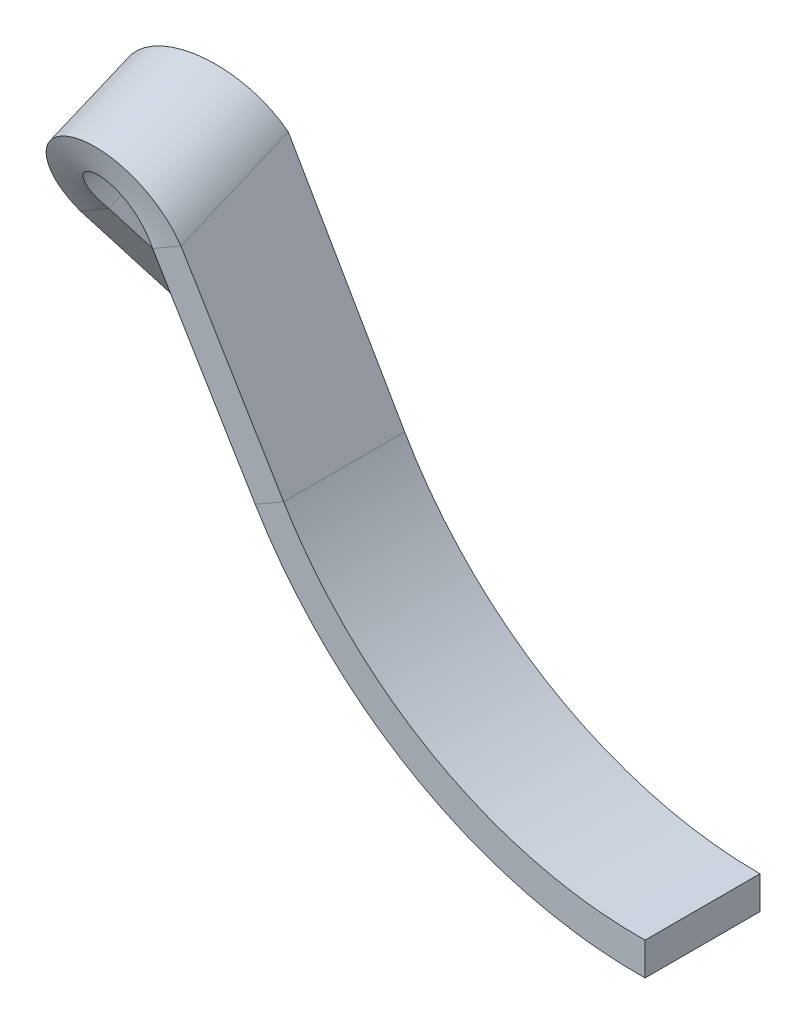
ISO-10303-21;
HEADER;
FILE_DESCRIPTION(('STEP AP214'),'2;1');
FILE_NAME('part.step','',(''),(''),'','','');
FILE_SCHEMA(('AUTOMOTIVE_DESIGN { 1 0 10303 214 1 1 1 1 }'));
ENDSEC;
DATA;
#1=APPLICATION_CONTEXT('core data for automotive mechanical design processes');
#2=APPLICATION_PROTOCOL_DEFINITION('international standard','automotive_design',2000,#1);
#3=PRODUCT_CONTEXT('',#1,'mechanical');
#4=PRODUCT('Part','Part','',(#3));
#5=PRODUCT_RELATED_PRODUCT_CATEGORY('part','',(#4));
#6=PRODUCT_DEFINITION_FORMATION('','',#4);
#7=PRODUCT_DEFINITION_CONTEXT('part definition',#1,'design');
#8=PRODUCT_DEFINITION('design','',#6,#7);
#9=PRODUCT_DEFINITION_SHAPE('','',#8);
#10=(LENGTH_UNIT() NAMED_UNIT(*) SI_UNIT(.MILLI.,.METRE.));
#11=(NAMED_UNIT(*) PLANE_ANGLE_UNIT() SI_UNIT($,.RADIAN.));
#12=(NAMED_UNIT(*) SI_UNIT($,.STERADIAN.) SOLID_ANGLE_UNIT());
#13=UNCERTAINTY_MEASURE_WITH_UNIT(LENGTH_MEASURE(1.E-05),#10,'distance_accuracy_value','');
#14=(GEOMETRIC_REPRESENTATION_CONTEXT(3) GLOBAL_UNCERTAINTY_ASSIGNED_CONTEXT((#13)) GLOBAL_UNIT_ASSIGNED_CONTEXT((#10,
#11,#12)) REPRESENTATION_CONTEXT('',''));
#15=CARTESIAN_POINT('',(0.,0.,0.));
#16=DIRECTION('',(0.,0.,1.));
#17=DIRECTION('',(1.,0.,0.));
#18=AXIS2_PLACEMENT_3D('',#15,#16,#17);
#19=CARTESIAN_POINT('',(-8.66025403784438,4.99999999999999,10.));
#20=DIRECTION('',(-0.866025403784438,-0.500000000000001,0.));
#21=DIRECTION('',(0.500000000000001,-0.866025403784438,0.));
#22=AXIS2_PLACEMENT_3D('',#19,#20,#21);
#23=PLANE('',#22);
#24=DIRECTION('',(0.499951953594902,-0.865942184969686,-0.0138627698014347));
#25=VECTOR('',#24,1.);
#26=CARTESIAN_POINT('',(-8.70910873098918,5.08461881071497,2.95234657146394));
#27=LINE('',#26,#25);
#28=CARTESIAN_POINT('',(-11.0955950619202,9.21813438745605,3.01851955149149));
#29=VERTEX_POINT('',#28);
#30=CARTESIAN_POINT('',(-8.66025403784438,4.99999999999999,2.95099191856196));
#31=VERTEX_POINT('',#30);
#32=EDGE_CURVE('E66',#29,#31,#27,.T.);
#33=ORIENTED_EDGE('',*,*,#32,.T.);
#34=DIRECTION('',(0.,0.,-1.));
#35=VECTOR('',#34,1.);
#36=CARTESIAN_POINT('',(-8.66025403784438,4.99999999999999,10.));
#37=LINE('',#36,#35);
#38=CARTESIAN_POINT('',(-8.66025403784438,4.99999999999999,0.));
#39=VERTEX_POINT('',#38);
#40=EDGE_CURVE('E59',#31,#39,#37,.T.);
#41=ORIENTED_EDGE('',*,*,#40,.T.);
#42=DIRECTION('',(-0.500000000000001,0.866025403784438,0.));
#43=VECTOR('',#42,1.);
#44=CARTESIAN_POINT('',(-8.66025403784438,4.99999999999999,0.));
#45=LINE('',#44,#43);
#46=CARTESIAN_POINT('',(-11.5,9.91858428704207,0.));
#47=VERTEX_POINT('',#46);
#48=EDGE_CURVE('E74',#39,#47,#45,.T.);
#49=ORIENTED_EDGE('',*,*,#48,.T.);
#50=DIRECTION('',(-0.129409522551257,0.224143868042008,-0.96592582628907));
#51=VECTOR('',#50,1.);
#52=CARTESIAN_POINT('',(-10.1602540378444,7.59807621135337,10.));
#53=LINE('',#52,#51);
#54=EDGE_CURVE('E329',#29,#47,#53,.T.);
#55=ORIENTED_EDGE('',*,*,#54,.F.);
#56=EDGE_LOOP('',(#33,#41,#49,#55));
#57=FACE_BOUND('',#56,.T.);
#58=ADVANCED_FACE('F51',(#57),#23,.F.);
#59=CARTESIAN_POINT('',(-9.35307436087193,4.59999999999999,10.));
#60=DIRECTION('',(-0.866025403784438,-0.500000000000001,0.));
#61=DIRECTION('',(0.500000000000001,-0.866025403784438,0.));
#62=AXIS2_PLACEMENT_3D('',#59,#60,#61);
#63=PLANE('',#62);
#64=DIRECTION('',(0.,0.,-1.));
#65=VECTOR('',#64,1.);
#66=CARTESIAN_POINT('',(-9.35307436087193,4.59999999999999,10.));
#67=LINE('',#66,#65);
#68=CARTESIAN_POINT('',(-9.35307436087193,4.59999999999999,2.95099191856196));
#69=VERTEX_POINT('',#68);
#70=CARTESIAN_POINT('',(-9.35307436087193,4.59999999999999,0.));
#71=VERTEX_POINT('',#70);
#72=EDGE_CURVE('E156',#69,#71,#67,.T.);
#73=ORIENTED_EDGE('',*,*,#72,.F.);
#74=DIRECTION('',(0.499951953594902,-0.865942184969686,-0.0138627698014347));
#75=VECTOR('',#74,1.);
#76=CARTESIAN_POINT('',(-9.40192905401673,4.68461881071497,2.95234657146394));
#77=LINE('',#76,#75);
#78=CARTESIAN_POINT('',(-11.7884153849477,8.81813438745606,3.01851955149148));
#79=VERTEX_POINT('',#78);
#80=EDGE_CURVE('E325',#79,#69,#77,.T.);
#81=ORIENTED_EDGE('',*,*,#80,.F.);
#82=DIRECTION('',(-0.129409522551257,0.224143868042008,-0.96592582628907));
#83=VECTOR('',#82,1.);
#84=CARTESIAN_POINT('',(-10.853074360872,7.19807621135337,10.));
#85=LINE('',#84,#83);
#86=CARTESIAN_POINT('',(-12.1928203230275,9.51858428704208,0.));
#87=VERTEX_POINT('',#86);
#88=EDGE_CURVE('E414',#79,#87,#85,.T.);
#89=ORIENTED_EDGE('',*,*,#88,.T.);
#90=DIRECTION('',(-0.500000000000001,0.866025403784438,0.));
#91=VECTOR('',#90,1.);
#92=CARTESIAN_POINT('',(-9.35307436087193,4.59999999999999,0.));
#93=LINE('',#92,#91);
#94=EDGE_CURVE('E411',#71,#87,#93,.T.);
#95=ORIENTED_EDGE('',*,*,#94,.F.);
#96=EDGE_LOOP('',(#73,#81,#89,#95));
#97=FACE_BOUND('',#96,.T.);
#98=ADVANCED_FACE('F423',(#97),#63,.T.);
#99=CARTESIAN_POINT('',(0.,10.,0.));
#100=DIRECTION('',(0.,0.,1.));
#101=DIRECTION('',(1.,0.,0.));
#102=AXIS2_PLACEMENT_3D('',#99,#100,#101);
#103=PLANE('',#102);
#104=ORIENTED_EDGE('',*,*,#48,.F.);
#105=DIRECTION('',(-0.866025403784439,-0.5,0.));
#106=VECTOR('',#105,1.);
#107=CARTESIAN_POINT('',(-8.66025403784438,4.99999999999999,0.));
#108=LINE('',#107,#106);
#109=EDGE_CURVE('E284',#39,#71,#108,.T.);
#110=ORIENTED_EDGE('',*,*,#109,.T.);
#111=ORIENTED_EDGE('',*,*,#94,.T.);
#112=DIRECTION('',(0.866025403784439,0.499999999999999,0.));
#113=VECTOR('',#112,1.);
#114=CARTESIAN_POINT('',(-12.1928203230276,9.51858428704207,0.));
#115=LINE('',#114,#113);
#116=EDGE_CURVE('E287',#87,#47,#115,.T.);
#117=ORIENTED_EDGE('',*,*,#116,.T.);
#118=EDGE_LOOP('',(#104,#110,#111,#117));
#119=FACE_BOUND('',#118,.T.);
#120=ADVANCED_FACE('F308',(#119),#103,.F.);
#121=CARTESIAN_POINT('',(-8.70910873098918,5.08461881071497,2.95234657146394));
#122=DIRECTION('',(-0.00693138490071734,0.0120055108148582,-0.999903907189802));
#123=DIRECTION('',(0.499951953594902,-0.865942184969686,-0.0138627698014347));
#124=AXIS2_PLACEMENT_3D('',#121,#122,#123);
#125=PLANE('',#124);
#126=CARTESIAN_POINT('',(-8.66025403784438,4.99999999999999,2.95099191856196));
#127=CARTESIAN_POINT('',(-9.35307436087193,4.59999999999999,2.95099191856196));
#128=B_SPLINE_CURVE_WITH_KNOTS('',1,(#126,#127),.UNSPECIFIED.,.F.,.F.,(2,2),(0.,1.),.UNSPECIFIED.);
#129=EDGE_CURVE('E12',#31,#69,#128,.T.);
#130=ORIENTED_EDGE('',*,*,#129,.F.);
#131=ORIENTED_EDGE('',*,*,#32,.F.);
#132=CARTESIAN_POINT('',(-11.7884153849477,8.81813438745606,3.01851955149148));
#133=CARTESIAN_POINT('',(-11.0955950619202,9.21813438745606,3.01851955149148));
#134=B_SPLINE_CURVE_WITH_KNOTS('',1,(#132,#133),.UNSPECIFIED.,.F.,.F.,(2,2),(0.,1.),.UNSPECIFIED.);
#135=EDGE_CURVE('E332',#29,#79,#134,.F.);
#136=ORIENTED_EDGE('',*,*,#135,.T.);
#137=ORIENTED_EDGE('',*,*,#80,.T.);
#138=EDGE_LOOP('',(#130,#131,#136,#137));
#139=FACE_BOUND('',#138,.T.);
#140=ADVANCED_FACE('F297',(#139),#125,.F.);
#141=CARTESIAN_POINT('',(-11.0955950619202,9.21813438745606,3.01851955149148));
#142=CARTESIAN_POINT('',(-11.2322946099257,9.45490494997343,3.03516275506586));
#143=CARTESIAN_POINT('',(-11.4151035081526,9.6648272241181,3.05177287075833));
#144=CARTESIAN_POINT('',(-11.846590736162,10.0014212437597,3.0744799826965));
#145=CARTESIAN_POINT('',(-12.0950812019068,10.1279292172063,3.08052360526664));
#146=CARTESIAN_POINT('',(-12.6211682269415,10.2801461718338,3.07311983997961));
#147=CARTESIAN_POINT('',(-12.8985633612725,10.3058049058911,3.05963380640934));
#148=CARTESIAN_POINT('',(-13.4413125666929,10.2542026117992,3.00716592874818));
#149=CARTESIAN_POINT('',(-13.706458656967,10.1769715306974,2.96816316974808));
#150=CARTESIAN_POINT('',(-14.185395760213,9.93313743717271,2.86253854716561));
#151=CARTESIAN_POINT('',(-14.3990038997068,9.76664000680152,2.79591668358325));
#152=CARTESIAN_POINT('',(-14.7433694323159,9.37142711200837,2.63713531607947));
#153=CARTESIAN_POINT('',(-14.8739969001198,9.14287679073226,2.54499672706728));
#154=CARTESIAN_POINT('',(-15.0335186953649,8.66018414307598,2.34115124718938));
#155=CARTESIAN_POINT('',(-15.0623558256122,8.40624137938885,2.22948300203677));
#156=CARTESIAN_POINT('',(-15.0149025001671,7.91328602664222,1.99552664493367));
#157=CARTESIAN_POINT('',(-14.9386574935195,7.67451377564533,1.8733101914117));
#158=CARTESIAN_POINT('',(-14.8161114113672,7.46225773508906,1.75102408050189));
#159=CARTESIAN_POINT('',(-11.7884153849477,8.81813438745606,3.01851955149148));
#160=CARTESIAN_POINT('',(-11.8745294792953,8.96728837411391,3.00805471042918));
#161=CARTESIAN_POINT('',(-11.9887599560303,9.10007305526244,2.99757660076836));
#162=CARTESIAN_POINT('',(-12.2573842720988,9.31487829805639,2.97020303582042));
#163=CARTESIAN_POINT('',(-12.4116640226575,9.39679979971298,2.95327848907881));
#164=CARTESIAN_POINT('',(-12.7379711417902,9.4991800028641,2.9075446331399));
#165=CARTESIAN_POINT('',(-12.9098756902674,9.51960806586868,2.8787117594834));
#166=CARTESIAN_POINT('',(-13.246342675489,9.49770823931295,2.8054997862432));
#167=CARTESIAN_POINT('',(-13.4107782946631,9.45539861014735,2.76110793366607));
#168=CARTESIAN_POINT('',(-13.7083354614856,9.3162842717423,2.6554833110836));
#169=CARTESIAN_POINT('',(-13.8413455009157,9.21954394180268,2.59425054107827));
#170=CARTESIAN_POINT('',(-14.0568468319841,8.98812545628273,2.45621326915354));
#171=CARTESIAN_POINT('',(-14.1392589008715,8.85354799774255,2.37942152022757));
#172=CARTESIAN_POINT('',(-14.2420506359861,8.56878819950117,2.21390613100155));
#173=CARTESIAN_POINT('',(-14.2623954258756,8.4187275443689,2.1252060551607));
#174=CARTESIAN_POINT('',(-14.2389828191061,8.12770999912122,1.9413303749437));
#175=CARTESIAN_POINT('',(-14.195251871403,7.98689746750723,1.84620099305603));
#176=CARTESIAN_POINT('',(-14.1232910883397,7.86225773508907,1.75102408050189));
#177=B_SPLINE_SURFACE_WITH_KNOTS('',1,3,((#141,#142,#143,#144,#145,#146,#147,#148,#149,#150,
#151,#152,#153,#154,#155,#156,#157,#158),(#159,#160,#161,#162,#163,#164,#165,#166,#167,#168,
#169,#170,#171,#172,#173,#174,#175,#176)),.UNSPECIFIED.,.F.,.F.,.F.,(2,2),(4,2,2,2,2,2,2,2,4),
(0.,1.),(0.,0.125,0.25,0.375,0.5,0.625,0.75,0.875,1.),.UNSPECIFIED.);
#178=CARTESIAN_POINT('',(-11.0955950619202,9.21813438745606,3.01851955149148));
#179=CARTESIAN_POINT('',(-11.2322946099257,9.45490494997343,3.03516275506586));
#180=CARTESIAN_POINT('',(-11.4151035081526,9.6648272241181,3.05177287075833));
#181=CARTESIAN_POINT('',(-11.846590736162,10.0014212437597,3.0744799826965));
#182=CARTESIAN_POINT('',(-12.0950812019068,10.1279292172063,3.08052360526664));
#183=CARTESIAN_POINT('',(-12.6211682269415,10.2801461718338,3.07311983997961));
#184=CARTESIAN_POINT('',(-12.8985633612725,10.3058049058911,3.05963380640934));
#185=CARTESIAN_POINT('',(-13.4413125666929,10.2542026117992,3.00716592874818));
#186=CARTESIAN_POINT('',(-13.706458656967,10.1769715306974,2.96816316974808));
#187=CARTESIAN_POINT('',(-14.185395760213,9.93313743717271,2.86253854716561));
#188=CARTESIAN_POINT('',(-14.3990038997068,9.76664000680152,2.79591668358325));
#189=CARTESIAN_POINT('',(-14.7433694323159,9.37142711200837,2.63713531607947));
#190=CARTESIAN_POINT('',(-14.8739969001198,9.14287679073226,2.54499672706728));
#191=CARTESIAN_POINT('',(-15.0335186953649,8.66018414307598,2.34115124718938));
#192=CARTESIAN_POINT('',(-15.0623558256122,8.40624137938885,2.22948300203677));
#193=CARTESIAN_POINT('',(-15.0149025001671,7.91328602664222,1.99552664493367));
#194=CARTESIAN_POINT('',(-14.9386574935195,7.67451377564533,1.8733101914117));
#195=CARTESIAN_POINT('',(-14.8161114113672,7.46225773508906,1.75102408050189));
#196=B_SPLINE_CURVE_WITH_KNOTS('',3,(#178,#179,#180,#181,#182,#183,#184,#185,#186,#187,#188,
#189,#190,#191,#192,#193,#194,#195),.UNSPECIFIED.,.F.,.F.,(4,2,2,2,2,2,2,2,4),(0.,0.125,0.25,
0.375,0.5,0.625,0.75,0.875,1.),.UNSPECIFIED.);
#197=CARTESIAN_POINT('',(-14.8161114113672,7.46225773508907,1.75102408050189));
#198=VERTEX_POINT('',#197);
#199=EDGE_CURVE('E357',#29,#198,#196,.T.);
#200=CARTESIAN_POINT('',(-14.8161114113672,7.46225773508906,1.75102408050189));
#201=CARTESIAN_POINT('',(-14.1232910883397,7.86225773508907,1.75102408050189));
#202=B_SPLINE_CURVE_WITH_KNOTS('',1,(#200,#201),.UNSPECIFIED.,.F.,.F.,(2,2),(0.,1.),.UNSPECIFIED.);
#203=CARTESIAN_POINT('',(-14.1232910883397,7.86225773508907,1.75102408050189));
#204=VERTEX_POINT('',#203);
#205=EDGE_CURVE('E281',#204,#198,#202,.F.);
#206=CARTESIAN_POINT('',(-14.1232910883397,7.86225773508907,1.75102408050189));
#207=CARTESIAN_POINT('',(-14.195251871403,7.98689746750723,1.84620099305603));
#208=CARTESIAN_POINT('',(-14.2389828191061,8.12770999912122,1.9413303749437));
#209=CARTESIAN_POINT('',(-14.2623954258756,8.4187275443689,2.1252060551607));
#210=CARTESIAN_POINT('',(-14.2420506359861,8.56878819950117,2.21390613100155));
#211=CARTESIAN_POINT('',(-14.1392589008715,8.85354799774255,2.37942152022757));
#212=CARTESIAN_POINT('',(-14.0568468319841,8.98812545628273,2.45621326915354));
#213=CARTESIAN_POINT('',(-13.8413455009157,9.21954394180268,2.59425054107827));
#214=CARTESIAN_POINT('',(-13.7083354614856,9.3162842717423,2.6554833110836));
#215=CARTESIAN_POINT('',(-13.4107782946631,9.45539861014735,2.76110793366607));
#216=CARTESIAN_POINT('',(-13.246342675489,9.49770823931295,2.8054997862432));
#217=CARTESIAN_POINT('',(-12.9098756902674,9.51960806586868,2.8787117594834));
#218=CARTESIAN_POINT('',(-12.7379711417902,9.4991800028641,2.9075446331399));
#219=CARTESIAN_POINT('',(-12.4116640226575,9.39679979971298,2.95327848907881));
#220=CARTESIAN_POINT('',(-12.2573842720988,9.31487829805639,2.97020303582042));
#221=CARTESIAN_POINT('',(-11.9887599560303,9.10007305526244,2.99757660076836));
#222=CARTESIAN_POINT('',(-11.8745294792953,8.96728837411391,3.00805471042918));
#223=CARTESIAN_POINT('',(-11.7884153849477,8.81813438745606,3.01851955149148));
#224=B_SPLINE_CURVE_WITH_KNOTS('',3,(#206,#207,#208,#209,#210,#211,#212,#213,#214,#215,#216,
#217,#218,#219,#220,#221,#222,#223),.UNSPECIFIED.,.F.,.F.,(4,2,2,2,2,2,2,2,4),(0.,0.125,0.25,
0.375,0.5,0.625,0.75,0.875,1.),.UNSPECIFIED.);
#225=EDGE_CURVE('E429',#79,#204,#224,.F.);
#226=ORIENTED_EDGE('',*,*,#135,.F.);
#227=ORIENTED_EDGE('',*,*,#199,.T.);
#228=ORIENTED_EDGE('',*,*,#205,.F.);
#229=ORIENTED_EDGE('',*,*,#225,.F.);
#230=EDGE_LOOP('',(#226,#227,#228,#229));
#231=FACE_BOUND('',#230,.T.);
#232=ADVANCED_FACE('F307',(#231),#177,.F.);
#233=CARTESIAN_POINT('',(-13.2753520777581,8.89358428704208,0.));
#234=DIRECTION('',(0.129409522551259,-0.22414386804201,0.965925826289069));
#235=DIRECTION('',(0.,-0.974116947696298,-0.226044624379453));
#236=AXIS2_PLACEMENT_3D('',#233,#234,#235);
#237=PLANE('',#236);
#238=CARTESIAN_POINT('',(-13.2753520777581,8.89358428704208,0.));
#239=DIRECTION('',(-0.129409522551257,0.224143868042008,-0.96592582628907));
#240=DIRECTION('',(0.,0.974116947696299,0.22604462437945));
#241=AXIS2_PLACEMENT_3D('',#238,#239,#240);
#242=CIRCLE('',#241,2.05);
#243=CARTESIAN_POINT('',(-15.0507041555162,7.86858428704207,0.));
#244=VERTEX_POINT('',#243);
#245=EDGE_CURVE('E359',#244,#47,#242,.T.);
#246=ORIENTED_EDGE('',*,*,#245,.T.);
#247=ORIENTED_EDGE('',*,*,#116,.F.);
#248=CARTESIAN_POINT('',(-13.2753520777581,8.89358428704208,0.));
#249=DIRECTION('',(-0.129409522551259,0.22414386804201,-0.965925826289069));
#250=DIRECTION('',(0.,0.974116947696298,0.226044624379453));
#251=AXIS2_PLACEMENT_3D('',#248,#249,#250);
#252=CIRCLE('',#251,1.25);
#253=CARTESIAN_POINT('',(-14.3578838324886,8.26858428704207,0.));
#254=VERTEX_POINT('',#253);
#255=EDGE_CURVE('E326',#254,#87,#252,.T.);
#256=ORIENTED_EDGE('',*,*,#255,.F.);
#257=DIRECTION('',(-0.866025403784438,-0.500000000000001,0.));
#258=VECTOR('',#257,1.);
#259=CARTESIAN_POINT('',(-15.0507041555162,7.86858428704207,0.));
#260=LINE('',#259,#258);
#261=EDGE_CURVE('E142',#254,#244,#260,.T.);
#262=ORIENTED_EDGE('',*,*,#261,.T.);
#263=EDGE_LOOP('',(#246,#247,#256,#262));
#264=FACE_BOUND('',#263,.T.);
#265=ADVANCED_FACE('F309',(#264),#237,.F.);
#266=CARTESIAN_POINT('',(-12.1391864166187,6.92568763613351,8.48045594637508));
#267=DIRECTION('',(-0.129409522551257,0.224143868042008,-0.96592582628907));
#268=DIRECTION('',(0.,0.974116947696299,0.22604462437945));
#269=AXIS2_PLACEMENT_3D('',#266,#267,#268);
#270=CYLINDRICAL_SURFACE('',#269,1.25);
#271=DIRECTION('',(0.129409522551257,-0.224143868042007,0.96592582628907));
#272=VECTOR('',#271,1.);
#273=CARTESIAN_POINT('',(-13.6880108514109,7.10833024919772,5.));
#274=LINE('',#273,#272);
#275=EDGE_CURVE('E338',#254,#204,#274,.T.);
#276=ORIENTED_EDGE('',*,*,#275,.F.);
#277=ORIENTED_EDGE('',*,*,#255,.T.);
#278=ORIENTED_EDGE('',*,*,#88,.F.);
#279=ORIENTED_EDGE('',*,*,#225,.T.);
#280=EDGE_LOOP('',(#276,#277,#278,#279));
#281=FACE_BOUND('',#280,.T.);
#282=ADVANCED_FACE('F428',(#281),#270,.F.);
#283=CARTESIAN_POINT('',(-12.1391864166187,6.92568763613351,8.48045594637508));
#284=DIRECTION('',(-0.129409522551257,0.224143868042008,-0.96592582628907));
#285=DIRECTION('',(0.,0.974116947696299,0.22604462437945));
#286=AXIS2_PLACEMENT_3D('',#283,#284,#285);
#287=CYLINDRICAL_SURFACE('',#286,2.05);
#288=DIRECTION('',(0.129409522551257,-0.224143868042007,0.96592582628907));
#289=VECTOR('',#288,1.);
#290=CARTESIAN_POINT('',(-14.3808311744384,6.70833024919771,5.));
#291=LINE('',#290,#289);
#292=EDGE_CURVE('E267',#244,#198,#291,.T.);
#293=ORIENTED_EDGE('',*,*,#292,.T.);
#294=ORIENTED_EDGE('',*,*,#199,.F.);
#295=ORIENTED_EDGE('',*,*,#54,.T.);
#296=ORIENTED_EDGE('',*,*,#245,.F.);
#297=EDGE_LOOP('',(#293,#294,#295,#296));
#298=FACE_BOUND('',#297,.T.);
#299=ADVANCED_FACE('F248',(#298),#287,.T.);
#300=CARTESIAN_POINT('',(-10.3519072368619,1.33002928948479,7.75033973863527));
#301=DIRECTION('',(0.433012701892219,-0.749999999999999,-0.500000000000001));
#302=DIRECTION('',(0.,0.554700196225231,-0.832050294337843));
#303=AXIS2_PLACEMENT_3D('',#300,#301,#302);
#304=PLANE('',#303);
#305=DIRECTION('',(0.250000000000001,-0.43301270189222,0.866025403784438));
#306=VECTOR('',#305,1.);
#307=CARTESIAN_POINT('',(-10.3519072368619,1.33002928948479,7.75033973863527));
#308=LINE('',#307,#306);
#309=CARTESIAN_POINT('',(-13.0313991611731,5.97104544086235,-1.53169256411982));
#310=VERTEX_POINT('',#309);
#311=CARTESIAN_POINT('',(-12.5813991611731,5.19162257745636,0.0271531626922211));
#312=VERTEX_POINT('',#311);
#313=EDGE_CURVE('E275',#310,#312,#308,.T.);
#314=ORIENTED_EDGE('',*,*,#313,.T.);
#315=DIRECTION('',(0.866025403784438,0.500000000000001,0.));
#316=VECTOR('',#315,1.);
#317=CARTESIAN_POINT('',(-12.5813991611731,5.19162257745636,0.0271531626922211));
#318=LINE('',#317,#316);
#319=CARTESIAN_POINT('',(-13.2742194842007,4.79162257745635,0.0271531626922193));
#320=VERTEX_POINT('',#319);
#321=EDGE_CURVE('E339',#312,#320,#318,.F.);
#322=ORIENTED_EDGE('',*,*,#321,.T.);
#323=DIRECTION('',(0.250000000000001,-0.43301270189222,0.866025403784438));
#324=VECTOR('',#323,1.);
#325=CARTESIAN_POINT('',(-11.0447275598895,0.930029289484793,7.75033973863527));
#326=LINE('',#325,#324);
#327=CARTESIAN_POINT('',(-13.7242194842007,5.57104544086235,-1.53169256411982));
#328=VERTEX_POINT('',#327);
#329=EDGE_CURVE('E280',#328,#320,#326,.T.);
#330=ORIENTED_EDGE('',*,*,#329,.F.);
#331=DIRECTION('',(-0.866025403784438,-0.500000000000001,0.));
#332=VECTOR('',#331,1.);
#333=CARTESIAN_POINT('',(-13.0313991611731,5.97104544086235,-1.53169256411982));
#334=LINE('',#333,#332);
#335=EDGE_CURVE('E365',#310,#328,#334,.T.);
#336=ORIENTED_EDGE('',*,*,#335,.F.);
#337=EDGE_LOOP('',(#314,#322,#330,#336));
#338=FACE_BOUND('',#337,.T.);
#339=ADVANCED_FACE('F244',(#338),#304,.T.);
#340=CARTESIAN_POINT('',(-11.7682332716613,3.78317794183992,3.97119429571751));
#341=DIRECTION('',(-0.866025403784438,-0.500000000000001,0.));
#342=DIRECTION('',(0.500000000000001,-0.866025403784438,0.));
#343=AXIS2_PLACEMENT_3D('',#340,#341,#342);
#344=PLANE('',#343);
#345=DIRECTION('',(0.436436784935206,-0.755930685799786,-0.487946442780031));
#346=VECTOR('',#345,1.);
#347=CARTESIAN_POINT('',(-12.8017555768349,5.57329108515631,0.273516743575722));
#348=LINE('',#347,#346);
#349=EDGE_CURVE('E335',#204,#312,#348,.T.);
#350=ORIENTED_EDGE('',*,*,#349,.T.);
#351=ORIENTED_EDGE('',*,*,#313,.F.);
#352=DIRECTION('',(0.433012701892219,-0.749999999999999,-0.500000000000001));
#353=VECTOR('',#352,1.);
#354=CARTESIAN_POINT('',(-14.3578838324886,8.26858428704207,0.));
#355=LINE('',#354,#353);
#356=EDGE_CURVE('E633',#254,#310,#355,.T.);
#357=ORIENTED_EDGE('',*,*,#356,.F.);
#358=ORIENTED_EDGE('',*,*,#275,.T.);
#359=EDGE_LOOP('',(#350,#351,#357,#358));
#360=FACE_BOUND('',#359,.T.);
#361=ADVANCED_FACE('F247',(#360),#344,.F.);
#362=CARTESIAN_POINT('',(-12.8017555768349,5.57329108515631,0.273516743575722));
#363=DIRECTION('',(-0.243973221390016,0.422574015133757,-0.87287356987041));
#364=DIRECTION('',(0.436436784935206,-0.755930685799786,-0.487946442780031));
#365=AXIS2_PLACEMENT_3D('',#362,#363,#364);
#366=PLANE('',#365);
#367=ORIENTED_EDGE('',*,*,#321,.F.);
#368=ORIENTED_EDGE('',*,*,#349,.F.);
#369=ORIENTED_EDGE('',*,*,#205,.T.);
#370=DIRECTION('',(0.436436784935206,-0.755930685799786,-0.487946442780031));
#371=VECTOR('',#370,1.);
#372=CARTESIAN_POINT('',(-13.4945758998625,5.17329108515631,0.27351674357572));
#373=LINE('',#372,#371);
#374=EDGE_CURVE('E278',#198,#320,#373,.T.);
#375=ORIENTED_EDGE('',*,*,#374,.T.);
#376=EDGE_LOOP('',(#367,#368,#369,#375));
#377=FACE_BOUND('',#376,.T.);
#378=ADVANCED_FACE('F252',(#377),#366,.F.);
#379=CARTESIAN_POINT('',(-12.4610535946889,3.38317794183992,3.97119429571751));
#380=DIRECTION('',(-0.866025403784438,-0.500000000000001,0.));
#381=DIRECTION('',(0.500000000000001,-0.866025403784438,0.));
#382=AXIS2_PLACEMENT_3D('',#379,#380,#381);
#383=PLANE('',#382);
#384=ORIENTED_EDGE('',*,*,#329,.T.);
#385=ORIENTED_EDGE('',*,*,#374,.F.);
#386=ORIENTED_EDGE('',*,*,#292,.F.);
#387=DIRECTION('',(0.433012701892219,-0.749999999999999,-0.500000000000001));
#388=VECTOR('',#387,1.);
#389=CARTESIAN_POINT('',(-15.0507041555162,7.86858428704207,0.));
#390=LINE('',#389,#388);
#391=EDGE_CURVE('E629',#244,#328,#390,.T.);
#392=ORIENTED_EDGE('',*,*,#391,.T.);
#393=EDGE_LOOP('',(#384,#385,#386,#392));
#394=FACE_BOUND('',#393,.T.);
#395=ADVANCED_FACE('F257',(#394),#383,.T.);
#396=CARTESIAN_POINT('',(-14.3578838324886,8.26858428704207,0.));
#397=DIRECTION('',(-0.250000000000001,0.43301270189222,-0.866025403784438));
#398=DIRECTION('',(0.,0.894427190999915,0.447213595499959));
#399=AXIS2_PLACEMENT_3D('',#396,#397,#398);
#400=PLANE('',#399);
#401=ORIENTED_EDGE('',*,*,#391,.F.);
#402=ORIENTED_EDGE('',*,*,#261,.F.);
#403=ORIENTED_EDGE('',*,*,#356,.T.);
#404=ORIENTED_EDGE('',*,*,#335,.T.);
#405=EDGE_LOOP('',(#401,#402,#403,#404));
#406=FACE_BOUND('',#405,.T.);
#407=ADVANCED_FACE('F241',(#406),#400,.T.);
#408=CARTESIAN_POINT('',(0.,-0.800000000000007,1.4));
#409=DIRECTION('',(1.,0.,0.));
#410=DIRECTION('',(0.,0.,1.));
#411=AXIS2_PLACEMENT_3D('',#408,#409,#410);
#412=PLANE('',#411);
#413=DIRECTION('',(0.,-1.,0.));
#414=VECTOR('',#413,1.);
#415=CARTESIAN_POINT('',(0.,-0.800000000000007,0.));
#416=LINE('',#415,#414);
#417=CARTESIAN_POINT('',(0.,0.,0.));
#418=VERTEX_POINT('',#417);
#419=CARTESIAN_POINT('',(0.,-0.800000000000007,0.));
#420=VERTEX_POINT('',#419);
#421=EDGE_CURVE('E131',#418,#420,#416,.T.);
#422=ORIENTED_EDGE('',*,*,#421,.F.);
#423=DIRECTION('',(0.,0.,1.));
#424=VECTOR('',#423,1.);
#425=CARTESIAN_POINT('',(0.,0.,-10.4848500415969));
#426=LINE('',#425,#424);
#427=CARTESIAN_POINT('',(0.,0.,2.8));
#428=VERTEX_POINT('',#427);
#429=EDGE_CURVE('E191',#418,#428,#426,.T.);
#430=ORIENTED_EDGE('',*,*,#429,.T.);
#431=CARTESIAN_POINT('',(0.,-0.800000000000007,2.8));
#432=CARTESIAN_POINT('',(0.,0.,2.8));
#433=B_SPLINE_CURVE_WITH_KNOTS('',1,(#431,#432),.UNSPECIFIED.,.F.,.F.,(2,2),(0.,1.),.UNSPECIFIED.);
#434=CARTESIAN_POINT('',(0.,-0.800000000000007,2.8));
#435=VERTEX_POINT('',#434);
#436=EDGE_CURVE('E143',#428,#435,#433,.F.);
#437=ORIENTED_EDGE('',*,*,#436,.T.);
#438=DIRECTION('',(0.,0.,1.));
#439=VECTOR('',#438,1.);
#440=CARTESIAN_POINT('',(0.,-0.800000000000007,0.));
#441=LINE('',#440,#439);
#442=EDGE_CURVE('E146',#420,#435,#441,.T.);
#443=ORIENTED_EDGE('',*,*,#442,.F.);
#444=EDGE_LOOP('',(#422,#430,#437,#443));
#445=FACE_BOUND('',#444,.T.);
#446=ADVANCED_FACE('F147',(#445),#412,.T.);
#447=CARTESIAN_POINT('',(0.,-0.800000000000007,2.8));
#448=CARTESIAN_POINT('',(-0.942511521580104,-0.800000000000006,2.81258311013643));
#449=CARTESIAN_POINT('',(-1.88488204317252,-0.675930127132904,2.82516531976033));
#450=CARTESIAN_POINT('',(-3.70560933104195,-0.18806772071098,2.85033063952065));
#451=CARTESIAN_POINT('',(-4.58379028609461,0.17568674108959,2.86291329940082));
#452=CARTESIAN_POINT('',(-6.2162097139054,1.11816453716653,2.88807861916115));
#453=CARTESIAN_POINT('',(-6.97032079609096,1.69681432246153,2.90066127904131));
#454=CARTESIAN_POINT('',(-8.30318567753847,3.02967920390904,2.92582659880163));
#455=CARTESIAN_POINT('',(-8.88181860008189,3.7837610789521,2.93840880842553));
#456=CARTESIAN_POINT('',(-9.35307436087193,4.59999999999999,2.95099191856196));
#457=CARTESIAN_POINT('',(0.,0.,2.8));
#458=CARTESIAN_POINT('',(-0.872695852388933,0.,2.81258311012308));
#459=CARTESIAN_POINT('',(-1.74526115108566,0.114879511913978,2.82516531976033));
#460=CARTESIAN_POINT('',(-3.43111975096476,0.566603962304647,2.85033063952065));
#461=CARTESIAN_POINT('',(-4.24425026490241,0.903413649157027,2.86291329940082));
#462=CARTESIAN_POINT('',(-5.75574973509759,1.77607827515419,2.88807861916115));
#463=CARTESIAN_POINT('',(-6.45400073712126,2.3118651133903,2.90066127904131));
#464=CARTESIAN_POINT('',(-7.68813488660969,3.54599926287874,2.92582659880163));
#465=CARTESIAN_POINT('',(-8.22390611164992,4.24422322205386,2.93840880843888));
#466=CARTESIAN_POINT('',(-8.66025403784438,4.99999999999999,2.95099191856196));
#467=B_SPLINE_SURFACE_WITH_KNOTS('',1,3,((#447,#448,#449,#450,#451,#452,#453,#454,#455,#456),
(#457,#458,#459,#460,#461,#462,#463,#464,#465,#466)),.UNSPECIFIED.,.F.,.F.,.F.,(2,2),(4,2,2,2,
4),(0.,1.),(0.,0.25,0.5,0.75,1.),.UNSPECIFIED.);
#468=CARTESIAN_POINT('',(0.,0.,2.8));
#469=CARTESIAN_POINT('',(-0.872695852388933,0.,2.81258311012308));
#470=CARTESIAN_POINT('',(-1.74526115108566,0.114879511913978,2.82516531976033));
#471=CARTESIAN_POINT('',(-3.43111975096476,0.566603962304647,2.85033063952065));
#472=CARTESIAN_POINT('',(-4.24425026490241,0.903413649157027,2.86291329940082));
#473=CARTESIAN_POINT('',(-5.75574973509759,1.77607827515419,2.88807861916115));
#474=CARTESIAN_POINT('',(-6.45400073712126,2.3118651133903,2.90066127904131));
#475=CARTESIAN_POINT('',(-7.68813488660969,3.54599926287874,2.92582659880163));
#476=CARTESIAN_POINT('',(-8.22390611164992,4.24422322205386,2.93840880843888));
#477=CARTESIAN_POINT('',(-8.66025403784438,4.99999999999999,2.95099191856196));
#478=B_SPLINE_CURVE_WITH_KNOTS('',3,(#468,#469,#470,#471,#472,#473,#474,#475,#476,#477),
.UNSPECIFIED.,.F.,.F.,(4,2,2,2,4),(0.,0.25,0.5,0.75,1.),.UNSPECIFIED.);
#479=EDGE_CURVE('E161',#428,#31,#478,.T.);
#480=CARTESIAN_POINT('',(-9.35307436087193,4.59999999999999,2.95099191856196));
#481=CARTESIAN_POINT('',(-8.88181860008189,3.7837610789521,2.93840880842553));
#482=CARTESIAN_POINT('',(-8.30318567753847,3.02967920390904,2.92582659880163));
#483=CARTESIAN_POINT('',(-6.97032079609096,1.69681432246153,2.90066127904131));
#484=CARTESIAN_POINT('',(-6.2162097139054,1.11816453716653,2.88807861916115));
#485=CARTESIAN_POINT('',(-4.58379028609461,0.17568674108959,2.86291329940082));
#486=CARTESIAN_POINT('',(-3.70560933104195,-0.18806772071098,2.85033063952065));
#487=CARTESIAN_POINT('',(-1.88488204317252,-0.675930127132904,2.82516531976033));
#488=CARTESIAN_POINT('',(-0.942511521580104,-0.800000000000006,2.81258311013643));
#489=CARTESIAN_POINT('',(0.,-0.800000000000007,2.8));
#490=B_SPLINE_CURVE_WITH_KNOTS('',3,(#480,#481,#482,#483,#484,#485,#486,#487,#488,#489),
.UNSPECIFIED.,.F.,.F.,(4,2,2,2,4),(0.,0.25,0.5,0.75,1.),.UNSPECIFIED.);
#491=EDGE_CURVE('E152',#435,#69,#490,.F.);
#492=ORIENTED_EDGE('',*,*,#436,.F.);
#493=ORIENTED_EDGE('',*,*,#479,.T.);
#494=ORIENTED_EDGE('',*,*,#129,.T.);
#495=ORIENTED_EDGE('',*,*,#491,.F.);
#496=EDGE_LOOP('',(#492,#493,#494,#495));
#497=FACE_BOUND('',#496,.T.);
#498=ADVANCED_FACE('F179',(#497),#467,.T.);
#499=CARTESIAN_POINT('',(0.,9.99999999999999,0.));
#500=DIRECTION('',(0.,0.,-1.));
#501=DIRECTION('',(-1.,0.,0.));
#502=AXIS2_PLACEMENT_3D('',#499,#500,#501);
#503=PLANE('',#502);
#504=CARTESIAN_POINT('',(0.,9.99999999999999,0.));
#505=DIRECTION('',(0.,0.,1.));
#506=DIRECTION('',(1.,0.,0.));
#507=AXIS2_PLACEMENT_3D('',#504,#505,#506);
#508=CIRCLE('',#507,10.);
#509=EDGE_CURVE('E138',#39,#418,#508,.T.);
#510=ORIENTED_EDGE('',*,*,#509,.T.);
#511=ORIENTED_EDGE('',*,*,#421,.T.);
#512=CARTESIAN_POINT('',(0.,9.99999999999999,0.));
#513=DIRECTION('',(0.,0.,1.));
#514=DIRECTION('',(1.,0.,0.));
#515=AXIS2_PLACEMENT_3D('',#512,#513,#514);
#516=CIRCLE('',#515,10.8);
#517=EDGE_CURVE('E136',#71,#420,#516,.T.);
#518=ORIENTED_EDGE('',*,*,#517,.F.);
#519=ORIENTED_EDGE('',*,*,#109,.F.);
#520=EDGE_LOOP('',(#510,#511,#518,#519));
#521=FACE_BOUND('',#520,.T.);
#522=ADVANCED_FACE('F133',(#521),#503,.T.);
#523=CARTESIAN_POINT('',(0.,9.99999999999999,-10.4848500415969));
#524=DIRECTION('',(0.,0.,1.));
#525=DIRECTION('',(1.,0.,0.));
#526=AXIS2_PLACEMENT_3D('',#523,#524,#525);
#527=CYLINDRICAL_SURFACE('',#526,10.8);
#528=ORIENTED_EDGE('',*,*,#72,.T.);
#529=ORIENTED_EDGE('',*,*,#517,.T.);
#530=ORIENTED_EDGE('',*,*,#442,.T.);
#531=ORIENTED_EDGE('',*,*,#491,.T.);
#532=EDGE_LOOP('',(#528,#529,#530,#531));
#533=FACE_BOUND('',#532,.T.);
#534=ADVANCED_FACE('F155',(#533),#527,.T.);
#535=CARTESIAN_POINT('',(0.,9.99999999999999,-10.4848500415969));
#536=DIRECTION('',(0.,0.,1.));
#537=DIRECTION('',(1.,0.,0.));
#538=AXIS2_PLACEMENT_3D('',#535,#536,#537);
#539=CYLINDRICAL_SURFACE('',#538,10.);
#540=ORIENTED_EDGE('',*,*,#40,.F.);
#541=ORIENTED_EDGE('',*,*,#479,.F.);
#542=ORIENTED_EDGE('',*,*,#429,.F.);
#543=ORIENTED_EDGE('',*,*,#509,.F.);
#544=EDGE_LOOP('',(#540,#541,#542,#543));
#545=FACE_BOUND('',#544,.T.);
#546=ADVANCED_FACE('F174',(#545),#539,.F.);
#547=CLOSED_SHELL('',(#58,#98,#120,#140,#232,#265,#282,#299,#339,#361,#378,#395,#407,#446,#498,
#522,#534,#546));
#548=MANIFOLD_SOLID_BREP('B2',#547);
#549=ADVANCED_BREP_SHAPE_REPRESENTATION('',(#18,#548),#14);
#550=SHAPE_DEFINITION_REPRESENTATION(#9,#549);
ENDSEC;
END-ISO-10303-21;
